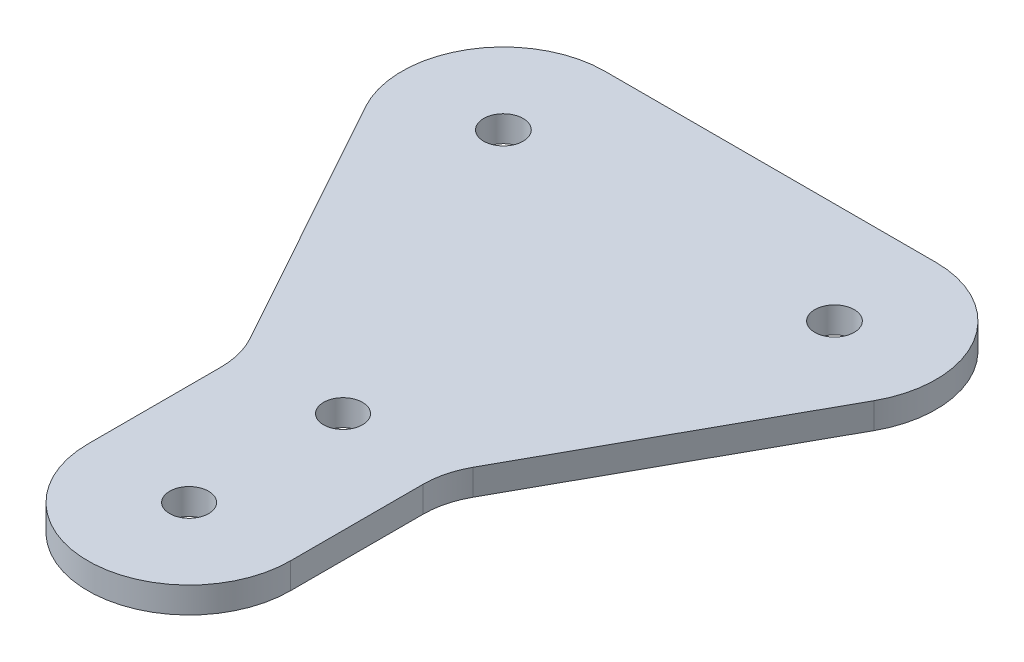
ISO-10303-21;
HEADER;
FILE_DESCRIPTION(('STEP AP214'),'2;1');
FILE_NAME('part.step','',(''),(''),'','','');
FILE_SCHEMA(('AUTOMOTIVE_DESIGN { 1 0 10303 214 1 1 1 1 }'));
ENDSEC;
DATA;
#1=APPLICATION_CONTEXT('core data for automotive mechanical design processes');
#2=APPLICATION_PROTOCOL_DEFINITION('international standard','automotive_design',2000,#1);
#3=PRODUCT_CONTEXT('',#1,'mechanical');
#4=PRODUCT('Part','Part','',(#3));
#5=PRODUCT_RELATED_PRODUCT_CATEGORY('part','',(#4));
#6=PRODUCT_DEFINITION_FORMATION('','',#4);
#7=PRODUCT_DEFINITION_CONTEXT('part definition',#1,'design');
#8=PRODUCT_DEFINITION('design','',#6,#7);
#9=PRODUCT_DEFINITION_SHAPE('','',#8);
#10=(LENGTH_UNIT() NAMED_UNIT(*) SI_UNIT(.MILLI.,.METRE.));
#11=(NAMED_UNIT(*) PLANE_ANGLE_UNIT() SI_UNIT($,.RADIAN.));
#12=(NAMED_UNIT(*) SI_UNIT($,.STERADIAN.) SOLID_ANGLE_UNIT());
#13=UNCERTAINTY_MEASURE_WITH_UNIT(LENGTH_MEASURE(1.E-05),#10,'distance_accuracy_value','');
#14=(GEOMETRIC_REPRESENTATION_CONTEXT(3) GLOBAL_UNCERTAINTY_ASSIGNED_CONTEXT((#13)) GLOBAL_UNIT_ASSIGNED_CONTEXT((#10,
#11,#12)) REPRESENTATION_CONTEXT('',''));
#15=CARTESIAN_POINT('',(0.,0.,0.));
#16=DIRECTION('',(0.,0.,1.));
#17=DIRECTION('',(1.,0.,0.));
#18=AXIS2_PLACEMENT_3D('',#15,#16,#17);
#19=CARTESIAN_POINT('',(12.3812499999981,3.175,-5.93428033430808E-13));
#20=DIRECTION('',(1.,0.,0.));
#21=DIRECTION('',(0.,0.,-1.));
#22=AXIS2_PLACEMENT_3D('',#19,#20,#21);
#23=PLANE('',#22);
#24=DIRECTION('',(0.,0.,1.));
#25=VECTOR('',#24,1.);
#26=CARTESIAN_POINT('',(12.3812499999981,0.,-5.93428033430808E-13));
#27=LINE('',#26,#25);
#28=CARTESIAN_POINT('',(12.3812499999987,0.,13.1142353977075));
#29=VERTEX_POINT('',#28);
#30=CARTESIAN_POINT('',(12.3812499999995,0.,29.3528750215412));
#31=VERTEX_POINT('',#30);
#32=EDGE_CURVE('E305',#29,#31,#27,.T.);
#33=ORIENTED_EDGE('',*,*,#32,.F.);
#34=DIRECTION('',(0.,-1.,0.));
#35=VECTOR('',#34,1.);
#36=CARTESIAN_POINT('',(12.3812499999987,3.175,13.1142353977075));
#37=LINE('',#36,#35);
#38=CARTESIAN_POINT('',(12.3812499999987,3.175,13.1142353977075));
#39=VERTEX_POINT('',#38);
#40=EDGE_CURVE('E55',#29,#39,#37,.F.);
#41=ORIENTED_EDGE('',*,*,#40,.T.);
#42=DIRECTION('',(0.,0.,1.));
#43=VECTOR('',#42,1.);
#44=CARTESIAN_POINT('',(12.3812499999981,3.175,-5.93428033430808E-13));
#45=LINE('',#44,#43);
#46=CARTESIAN_POINT('',(12.3812499999995,3.175,29.3528750215412));
#47=VERTEX_POINT('',#46);
#48=EDGE_CURVE('E143',#39,#47,#45,.T.);
#49=ORIENTED_EDGE('',*,*,#48,.T.);
#50=DIRECTION('',(0.,-1.,0.));
#51=VECTOR('',#50,1.);
#52=CARTESIAN_POINT('',(12.3812499999995,3.175,29.3528750215412));
#53=LINE('',#52,#51);
#54=EDGE_CURVE('E261',#47,#31,#53,.T.);
#55=ORIENTED_EDGE('',*,*,#54,.T.);
#56=EDGE_LOOP('',(#33,#41,#49,#55));
#57=FACE_BOUND('',#56,.T.);
#58=ADVANCED_FACE('F39',(#57),#23,.T.);
#59=CARTESIAN_POINT('',(13.9411713541731,3.175,7.71281282075999));
#60=DIRECTION('',(0.875016084061658,0.,0.484093846927847));
#61=DIRECTION('',(0.484093846927847,0.,-0.875016084061658));
#62=AXIS2_PLACEMENT_3D('',#59,#60,#61);
#63=PLANE('',#62);
#64=DIRECTION('',(-0.484093846927848,0.,0.875016084061658));
#65=VECTOR('',#64,1.);
#66=CARTESIAN_POINT('',(13.9411713541731,3.175,7.71281282075999));
#67=LINE('',#66,#65);
#68=CARTESIAN_POINT('',(31.1053746276231,3.175,-23.3120680565467));
#69=VERTEX_POINT('',#68);
#70=CARTESIAN_POINT('',(13.6310891593822,3.175,8.27329692842851));
#71=VERTEX_POINT('',#70);
#72=EDGE_CURVE('E120',#69,#71,#67,.T.);
#73=ORIENTED_EDGE('',*,*,#72,.T.);
#74=DIRECTION('',(0.,-1.,0.));
#75=VECTOR('',#74,1.);
#76=CARTESIAN_POINT('',(13.6310891593822,0.,8.27329692842851));
#77=LINE('',#76,#75);
#78=CARTESIAN_POINT('',(13.6310891593822,0.,8.27329692842851));
#79=VERTEX_POINT('',#78);
#80=EDGE_CURVE('E242',#71,#79,#77,.T.);
#81=ORIENTED_EDGE('',*,*,#80,.T.);
#82=DIRECTION('',(-0.484093846927848,0.,0.875016084061658));
#83=VECTOR('',#82,1.);
#84=CARTESIAN_POINT('',(13.9411713541731,0.,7.71281282075999));
#85=LINE('',#84,#83);
#86=CARTESIAN_POINT('',(31.1053746276231,0.,-23.3120680565467));
#87=VERTEX_POINT('',#86);
#88=EDGE_CURVE('E122',#87,#79,#85,.T.);
#89=ORIENTED_EDGE('',*,*,#88,.F.);
#90=DIRECTION('',(0.,-1.,0.));
#91=VECTOR('',#90,1.);
#92=CARTESIAN_POINT('',(31.1053746276231,3.175,-23.3120680565467));
#93=LINE('',#92,#91);
#94=EDGE_CURVE('E115',#69,#87,#93,.T.);
#95=ORIENTED_EDGE('',*,*,#94,.F.);
#96=EDGE_LOOP('',(#73,#81,#89,#95));
#97=FACE_BOUND('',#96,.T.);
#98=ADVANCED_FACE('F117',(#97),#63,.T.);
#99=CARTESIAN_POINT('',(20.2437999761667,3.175,-29.3211249784616));
#100=DIRECTION('',(0.,-1.,0.));
#101=DIRECTION('',(0.,0.,-1.));
#102=AXIS2_PLACEMENT_3D('',#99,#100,#101);
#103=CYLINDRICAL_SURFACE('',#102,12.4129999999979);
#104=CARTESIAN_POINT('',(20.2437999761667,0.,-29.3211249784616));
#105=DIRECTION('',(0.,1.,0.));
#106=DIRECTION('',(0.,0.,1.));
#107=AXIS2_PLACEMENT_3D('',#104,#105,#106);
#108=CIRCLE('',#107,12.4129999999979);
#109=CARTESIAN_POINT('',(20.2437999999999,0.,-41.7341249784605));
#110=VERTEX_POINT('',#109);
#111=EDGE_CURVE('E300',#87,#110,#108,.T.);
#112=ORIENTED_EDGE('',*,*,#111,.T.);
#113=DIRECTION('',(0.,-1.,0.));
#114=VECTOR('',#113,1.);
#115=CARTESIAN_POINT('',(20.2437999999999,3.175,-41.7341249784605));
#116=LINE('',#115,#114);
#117=CARTESIAN_POINT('',(20.2437999999999,3.175,-41.7341249784605));
#118=VERTEX_POINT('',#117);
#119=EDGE_CURVE('E128',#118,#110,#116,.T.);
#120=ORIENTED_EDGE('',*,*,#119,.F.);
#121=CARTESIAN_POINT('',(20.2437999761667,3.175,-29.3211249784616));
#122=DIRECTION('',(0.,1.,0.));
#123=DIRECTION('',(0.,0.,1.));
#124=AXIS2_PLACEMENT_3D('',#121,#122,#123);
#125=CIRCLE('',#124,12.4129999999979);
#126=EDGE_CURVE('E131',#69,#118,#125,.T.);
#127=ORIENTED_EDGE('',*,*,#126,.F.);
#128=ORIENTED_EDGE('',*,*,#94,.T.);
#129=EDGE_LOOP('',(#112,#120,#127,#128));
#130=FACE_BOUND('',#129,.T.);
#131=ADVANCED_FACE('F132',(#130),#103,.T.);
#132=CARTESIAN_POINT('',(0.,3.175,-41.7341249784616));
#133=DIRECTION('',(0.,0.,-1.));
#134=DIRECTION('',(-1.,0.,0.));
#135=AXIS2_PLACEMENT_3D('',#132,#133,#134);
#136=PLANE('',#135);
#137=DIRECTION('',(1.,0.,0.));
#138=VECTOR('',#137,1.);
#139=CARTESIAN_POINT('',(0.,0.,-41.7341249784616));
#140=LINE('',#139,#138);
#141=CARTESIAN_POINT('',(-20.2438000000003,0.,-41.7341249784608));
#142=VERTEX_POINT('',#141);
#143=EDGE_CURVE('E296',#142,#110,#140,.T.);
#144=ORIENTED_EDGE('',*,*,#143,.F.);
#145=DIRECTION('',(0.,-1.,0.));
#146=VECTOR('',#145,1.);
#147=CARTESIAN_POINT('',(-20.2438000000003,3.175,-41.7341249784608));
#148=LINE('',#147,#146);
#149=CARTESIAN_POINT('',(-20.2438000000003,3.175,-41.7341249784608));
#150=VERTEX_POINT('',#149);
#151=EDGE_CURVE('E251',#150,#142,#148,.T.);
#152=ORIENTED_EDGE('',*,*,#151,.F.);
#153=DIRECTION('',(1.,0.,0.));
#154=VECTOR('',#153,1.);
#155=CARTESIAN_POINT('',(0.,3.175,-41.7341249784616));
#156=LINE('',#155,#154);
#157=EDGE_CURVE('E137',#150,#118,#156,.T.);
#158=ORIENTED_EDGE('',*,*,#157,.T.);
#159=ORIENTED_EDGE('',*,*,#119,.T.);
#160=EDGE_LOOP('',(#144,#152,#158,#159));
#161=FACE_BOUND('',#160,.T.);
#162=ADVANCED_FACE('F205',(#161),#136,.T.);
#163=CARTESIAN_POINT('',(-20.2438000000003,3.175,-29.3211249784598));
#164=DIRECTION('',(0.,-1.,0.));
#165=DIRECTION('',(0.,0.,-1.));
#166=AXIS2_PLACEMENT_3D('',#163,#164,#165);
#167=CYLINDRICAL_SURFACE('',#166,12.4130000000002);
#168=CARTESIAN_POINT('',(-20.2438000000003,0.,-29.3211249784598));
#169=DIRECTION('',(0.,1.,0.));
#170=DIRECTION('',(0.,0.,1.));
#171=AXIS2_PLACEMENT_3D('',#168,#169,#170);
#172=CIRCLE('',#171,12.4130000000002);
#173=CARTESIAN_POINT('',(-31.1053746482185,0.,-23.3120680506876));
#174=VERTEX_POINT('',#173);
#175=EDGE_CURVE('E292',#142,#174,#172,.T.);
#176=ORIENTED_EDGE('',*,*,#175,.T.);
#177=DIRECTION('',(0.,-1.,0.));
#178=VECTOR('',#177,1.);
#179=CARTESIAN_POINT('',(-31.1053746482185,3.175,-23.3120680506876));
#180=LINE('',#179,#178);
#181=CARTESIAN_POINT('',(-31.1053746482185,3.175,-23.3120680506876));
#182=VERTEX_POINT('',#181);
#183=EDGE_CURVE('E254',#182,#174,#180,.T.);
#184=ORIENTED_EDGE('',*,*,#183,.F.);
#185=CARTESIAN_POINT('',(-20.2438000000003,3.175,-29.3211249784598));
#186=DIRECTION('',(0.,1.,0.));
#187=DIRECTION('',(0.,0.,1.));
#188=AXIS2_PLACEMENT_3D('',#185,#186,#187);
#189=CIRCLE('',#188,12.4130000000002);
#190=EDGE_CURVE('E151',#150,#182,#189,.T.);
#191=ORIENTED_EDGE('',*,*,#190,.F.);
#192=ORIENTED_EDGE('',*,*,#151,.T.);
#193=EDGE_LOOP('',(#176,#184,#191,#192));
#194=FACE_BOUND('',#193,.T.);
#195=ADVANCED_FACE('F201',(#194),#167,.T.);
#196=CARTESIAN_POINT('',(-13.9411713515368,3.175,7.71281282911911));
#197=DIRECTION('',(-0.875016083800641,0.,0.484093847399643));
#198=DIRECTION('',(0.484093847399643,0.,0.875016083800641));
#199=AXIS2_PLACEMENT_3D('',#196,#197,#198);
#200=PLANE('',#199);
#201=DIRECTION('',(-0.484093847399643,0.,-0.875016083800641));
#202=VECTOR('',#201,1.);
#203=CARTESIAN_POINT('',(-13.9411713515368,0.,7.71281282911911));
#204=LINE('',#203,#202);
#205=CARTESIAN_POINT('',(-13.6310891619948,0.,8.27329692658663));
#206=VERTEX_POINT('',#205);
#207=EDGE_CURVE('E289',#206,#174,#204,.T.);
#208=ORIENTED_EDGE('',*,*,#207,.F.);
#209=DIRECTION('',(0.,-1.,0.));
#210=VECTOR('',#209,1.);
#211=CARTESIAN_POINT('',(-13.6310891619948,3.175,8.27329692658663));
#212=LINE('',#211,#210);
#213=CARTESIAN_POINT('',(-13.6310891619948,3.175,8.27329692658663));
#214=VERTEX_POINT('',#213);
#215=EDGE_CURVE('E229',#206,#214,#212,.F.);
#216=ORIENTED_EDGE('',*,*,#215,.T.);
#217=DIRECTION('',(-0.484093847399643,0.,-0.875016083800641));
#218=VECTOR('',#217,1.);
#219=CARTESIAN_POINT('',(-13.9411713515368,3.175,7.71281282911911));
#220=LINE('',#219,#218);
#221=EDGE_CURVE('E155',#214,#182,#220,.T.);
#222=ORIENTED_EDGE('',*,*,#221,.T.);
#223=ORIENTED_EDGE('',*,*,#183,.T.);
#224=EDGE_LOOP('',(#208,#216,#222,#223));
#225=FACE_BOUND('',#224,.T.);
#226=ADVANCED_FACE('F197',(#225),#200,.T.);
#227=CARTESIAN_POINT('',(-12.3812500000019,3.175,5.77451124838615E-13));
#228=DIRECTION('',(-1.,0.,0.));
#229=DIRECTION('',(0.,0.,1.));
#230=AXIS2_PLACEMENT_3D('',#227,#228,#229);
#231=PLANE('',#230);
#232=DIRECTION('',(0.,0.,-1.));
#233=VECTOR('',#232,1.);
#234=CARTESIAN_POINT('',(-12.3812500000019,3.175,5.77451124838615E-13));
#235=LINE('',#234,#233);
#236=CARTESIAN_POINT('',(-12.3812500000005,3.175,29.3528750215412));
#237=VERTEX_POINT('',#236);
#238=CARTESIAN_POINT('',(-12.3812500000013,3.175,13.1142354005826));
#239=VERTEX_POINT('',#238);
#240=EDGE_CURVE('E158',#237,#239,#235,.T.);
#241=ORIENTED_EDGE('',*,*,#240,.T.);
#242=DIRECTION('',(0.,-1.,0.));
#243=VECTOR('',#242,1.);
#244=CARTESIAN_POINT('',(-12.3812500000013,0.,13.1142354005826));
#245=LINE('',#244,#243);
#246=CARTESIAN_POINT('',(-12.3812500000013,0.,13.1142354005826));
#247=VERTEX_POINT('',#246);
#248=EDGE_CURVE('E127',#239,#247,#245,.T.);
#249=ORIENTED_EDGE('',*,*,#248,.T.);
#250=DIRECTION('',(0.,0.,-1.));
#251=VECTOR('',#250,1.);
#252=CARTESIAN_POINT('',(-12.3812500000019,0.,5.77451124838615E-13));
#253=LINE('',#252,#251);
#254=CARTESIAN_POINT('',(-12.3812500000005,0.,29.3528750215412));
#255=VERTEX_POINT('',#254);
#256=EDGE_CURVE('E285',#255,#247,#253,.T.);
#257=ORIENTED_EDGE('',*,*,#256,.F.);
#258=DIRECTION('',(0.,-1.,0.));
#259=VECTOR('',#258,1.);
#260=CARTESIAN_POINT('',(-12.3812500000005,3.175,29.3528750215412));
#261=LINE('',#260,#259);
#262=EDGE_CURVE('E258',#237,#255,#261,.T.);
#263=ORIENTED_EDGE('',*,*,#262,.F.);
#264=EDGE_LOOP('',(#241,#249,#257,#263));
#265=FACE_BOUND('',#264,.T.);
#266=ADVANCED_FACE('F194',(#265),#231,.T.);
#267=CARTESIAN_POINT('',(-20.2438000000001,3.175,-29.3211249784589));
#268=DIRECTION('',(0.,-1.,0.));
#269=DIRECTION('',(0.,0.,-1.));
#270=AXIS2_PLACEMENT_3D('',#267,#268,#269);
#271=CYLINDRICAL_SURFACE('',#270,2.41299999999999);
#272=CARTESIAN_POINT('',(-20.2438000000001,3.175,-29.3211249784589));
#273=DIRECTION('',(0.,1.,0.));
#274=DIRECTION('',(0.,0.,1.));
#275=AXIS2_PLACEMENT_3D('',#272,#273,#274);
#276=CIRCLE('',#275,2.41299999999999);
#277=CARTESIAN_POINT('',(-20.2438000000001,3.175,-26.9081249784589));
#278=VERTEX_POINT('',#277);
#279=EDGE_CURVE('E175',#278,#278,#276,.T.);
#280=ORIENTED_EDGE('',*,*,#279,.T.);
#281=EDGE_LOOP('',(#280));
#282=FACE_BOUND('',#281,.T.);
#283=CARTESIAN_POINT('',(-20.2438000000001,0.,-29.3211249784589));
#284=DIRECTION('',(0.,1.,0.));
#285=DIRECTION('',(0.,0.,1.));
#286=AXIS2_PLACEMENT_3D('',#283,#284,#285);
#287=CIRCLE('',#286,2.41299999999999);
#288=CARTESIAN_POINT('',(-20.2438000000001,0.,-26.9081249784589));
#289=VERTEX_POINT('',#288);
#290=EDGE_CURVE('E269',#289,#289,#287,.T.);
#291=ORIENTED_EDGE('',*,*,#290,.F.);
#292=EDGE_LOOP('',(#291));
#293=FACE_BOUND('',#292,.T.);
#294=ADVANCED_FACE('F183',(#282,#293),#271,.F.);
#295=CARTESIAN_POINT('',(4.02455846426619E-13,3.175,10.5324236946353));
#296=DIRECTION('',(0.,1.,0.));
#297=DIRECTION('',(1.,0.,1.25300761309401E-12));
#298=AXIS2_PLACEMENT_3D('',#295,#296,#297);
#299=ELLIPSE('',#298,2.38125,2.38121635917891);
#300=DIRECTION('',(0.,-1.,0.));
#301=VECTOR('',#300,1.);
#302=SURFACE_OF_LINEAR_EXTRUSION('',#299,#301);
#303=CARTESIAN_POINT('',(2.3812500000004,3.175,10.5324236946383));
#304=VERTEX_POINT('',#303);
#305=EDGE_CURVE('E170',#304,#304,#299,.T.);
#306=ORIENTED_EDGE('',*,*,#305,.T.);
#307=EDGE_LOOP('',(#306));
#308=FACE_BOUND('',#307,.T.);
#309=CARTESIAN_POINT('',(4.02455846426619E-13,0.,10.5324236946353));
#310=DIRECTION('',(0.,1.,0.));
#311=DIRECTION('',(1.,0.,1.25300761309401E-12));
#312=AXIS2_PLACEMENT_3D('',#309,#310,#311);
#313=ELLIPSE('',#312,2.38125,2.38121635917891);
#314=CARTESIAN_POINT('',(2.3812500000004,0.,10.5324236946383));
#315=VERTEX_POINT('',#314);
#316=EDGE_CURVE('E273',#315,#315,#313,.T.);
#317=ORIENTED_EDGE('',*,*,#316,.F.);
#318=EDGE_LOOP('',(#317));
#319=FACE_BOUND('',#318,.T.);
#320=ADVANCED_FACE('F178',(#308,#319),#302,.T.);
#321=CARTESIAN_POINT('',(-4.85722573273506E-13,3.175,29.3528750215412));
#322=DIRECTION('',(0.,-1.,0.));
#323=DIRECTION('',(0.,0.,-1.));
#324=AXIS2_PLACEMENT_3D('',#321,#322,#323);
#325=CYLINDRICAL_SURFACE('',#324,2.38125);
#326=CARTESIAN_POINT('',(-4.85722573273506E-13,3.175,29.3528750215412));
#327=DIRECTION('',(0.,1.,0.));
#328=DIRECTION('',(0.,0.,1.));
#329=AXIS2_PLACEMENT_3D('',#326,#327,#328);
#330=CIRCLE('',#329,2.38125);
#331=CARTESIAN_POINT('',(-4.85722573273506E-13,3.175,31.7341250215412));
#332=VERTEX_POINT('',#331);
#333=EDGE_CURVE('E166',#332,#332,#330,.T.);
#334=ORIENTED_EDGE('',*,*,#333,.T.);
#335=EDGE_LOOP('',(#334));
#336=FACE_BOUND('',#335,.T.);
#337=CARTESIAN_POINT('',(-4.85722573273506E-13,0.,29.3528750215412));
#338=DIRECTION('',(0.,1.,0.));
#339=DIRECTION('',(0.,0.,1.));
#340=AXIS2_PLACEMENT_3D('',#337,#338,#339);
#341=CIRCLE('',#340,2.38125);
#342=CARTESIAN_POINT('',(-4.85722573273506E-13,0.,31.7341250215412));
#343=VERTEX_POINT('',#342);
#344=EDGE_CURVE('E277',#343,#343,#341,.T.);
#345=ORIENTED_EDGE('',*,*,#344,.F.);
#346=EDGE_LOOP('',(#345));
#347=FACE_BOUND('',#346,.T.);
#348=ADVANCED_FACE('F182',(#336,#347),#325,.F.);
#349=CARTESIAN_POINT('',(-4.85722573273506E-13,3.175,29.3528750215412));
#350=DIRECTION('',(0.,-1.,0.));
#351=DIRECTION('',(0.,0.,-1.));
#352=AXIS2_PLACEMENT_3D('',#349,#350,#351);
#353=CYLINDRICAL_SURFACE('',#352,12.38125);
#354=CARTESIAN_POINT('',(-4.85722573273506E-13,0.,29.3528750215412));
#355=DIRECTION('',(0.,1.,0.));
#356=DIRECTION('',(0.,0.,1.));
#357=AXIS2_PLACEMENT_3D('',#354,#355,#356);
#358=CIRCLE('',#357,12.38125);
#359=EDGE_CURVE('E281',#255,#31,#358,.T.);
#360=ORIENTED_EDGE('',*,*,#359,.T.);
#361=ORIENTED_EDGE('',*,*,#54,.F.);
#362=CARTESIAN_POINT('',(-4.85722573273506E-13,3.175,29.3528750215412));
#363=DIRECTION('',(0.,1.,0.));
#364=DIRECTION('',(0.,0.,1.));
#365=AXIS2_PLACEMENT_3D('',#362,#363,#364);
#366=CIRCLE('',#365,12.38125);
#367=EDGE_CURVE('E162',#237,#47,#366,.T.);
#368=ORIENTED_EDGE('',*,*,#367,.F.);
#369=ORIENTED_EDGE('',*,*,#262,.T.);
#370=EDGE_LOOP('',(#360,#361,#368,#369));
#371=FACE_BOUND('',#370,.T.);
#372=ADVANCED_FACE('F188',(#371),#353,.T.);
#373=CARTESIAN_POINT('',(20.2438000000001,3.175,-29.3211250215412));
#374=DIRECTION('',(0.,-1.,0.));
#375=DIRECTION('',(0.,0.,-1.));
#376=AXIS2_PLACEMENT_3D('',#373,#374,#375);
#377=CYLINDRICAL_SURFACE('',#376,2.41299999999999);
#378=CARTESIAN_POINT('',(20.2438000000001,3.175,-29.3211250215412));
#379=DIRECTION('',(0.,1.,0.));
#380=DIRECTION('',(0.,0.,1.));
#381=AXIS2_PLACEMENT_3D('',#378,#379,#380);
#382=CIRCLE('',#381,2.41299999999999);
#383=CARTESIAN_POINT('',(20.2438000000001,3.175,-26.9081250215412));
#384=VERTEX_POINT('',#383);
#385=EDGE_CURVE('E265',#384,#384,#382,.T.);
#386=ORIENTED_EDGE('',*,*,#385,.T.);
#387=EDGE_LOOP('',(#386));
#388=FACE_BOUND('',#387,.T.);
#389=CARTESIAN_POINT('',(20.2438000000001,0.,-29.3211250215412));
#390=DIRECTION('',(0.,1.,0.));
#391=DIRECTION('',(0.,0.,1.));
#392=AXIS2_PLACEMENT_3D('',#389,#390,#391);
#393=CIRCLE('',#392,2.41299999999999);
#394=CARTESIAN_POINT('',(20.2438000000001,0.,-26.9081250215412));
#395=VERTEX_POINT('',#394);
#396=EDGE_CURVE('E146',#395,#395,#393,.T.);
#397=ORIENTED_EDGE('',*,*,#396,.F.);
#398=EDGE_LOOP('',(#397));
#399=FACE_BOUND('',#398,.T.);
#400=ADVANCED_FACE('F192',(#388,#399),#377,.F.);
#401=CARTESIAN_POINT('',(0.,3.175,0.));
#402=DIRECTION('',(0.,1.,0.));
#403=DIRECTION('',(0.,0.,1.));
#404=AXIS2_PLACEMENT_3D('',#401,#402,#403);
#405=PLANE('',#404);
#406=ORIENTED_EDGE('',*,*,#48,.F.);
#407=CARTESIAN_POINT('',(22.3812499999987,3.175,13.114235397707));
#408=DIRECTION('',(0.,1.,0.));
#409=DIRECTION('',(0.,0.,1.));
#410=AXIS2_PLACEMENT_3D('',#407,#408,#409);
#411=CIRCLE('',#410,10.);
#412=EDGE_CURVE('E11',#39,#71,#411,.F.);
#413=ORIENTED_EDGE('',*,*,#412,.T.);
#414=ORIENTED_EDGE('',*,*,#72,.F.);
#415=ORIENTED_EDGE('',*,*,#126,.T.);
#416=ORIENTED_EDGE('',*,*,#157,.F.);
#417=ORIENTED_EDGE('',*,*,#190,.T.);
#418=ORIENTED_EDGE('',*,*,#221,.F.);
#419=CARTESIAN_POINT('',(-22.3812500000013,3.175,13.1142354005831));
#420=DIRECTION('',(0.,1.,0.));
#421=DIRECTION('',(0.,0.,1.));
#422=AXIS2_PLACEMENT_3D('',#419,#420,#421);
#423=CIRCLE('',#422,10.);
#424=EDGE_CURVE('E228',#214,#239,#423,.F.);
#425=ORIENTED_EDGE('',*,*,#424,.T.);
#426=ORIENTED_EDGE('',*,*,#240,.F.);
#427=ORIENTED_EDGE('',*,*,#367,.T.);
#428=EDGE_LOOP('',(#406,#413,#414,#415,#416,#417,#418,#425,#426,#427));
#429=FACE_BOUND('',#428,.T.);
#430=ORIENTED_EDGE('',*,*,#333,.F.);
#431=EDGE_LOOP('',(#430));
#432=FACE_BOUND('',#431,.T.);
#433=ORIENTED_EDGE('',*,*,#305,.F.);
#434=EDGE_LOOP('',(#433));
#435=FACE_BOUND('',#434,.T.);
#436=ORIENTED_EDGE('',*,*,#279,.F.);
#437=EDGE_LOOP('',(#436));
#438=FACE_BOUND('',#437,.T.);
#439=ORIENTED_EDGE('',*,*,#385,.F.);
#440=EDGE_LOOP('',(#439));
#441=FACE_BOUND('',#440,.T.);
#442=ADVANCED_FACE('F139',(#429,#432,#435,#438,#441),#405,.T.);
#443=CARTESIAN_POINT('',(0.,0.,0.));
#444=DIRECTION('',(0.,1.,0.));
#445=DIRECTION('',(0.,0.,1.));
#446=AXIS2_PLACEMENT_3D('',#443,#444,#445);
#447=PLANE('',#446);
#448=ORIENTED_EDGE('',*,*,#88,.T.);
#449=CARTESIAN_POINT('',(22.3812499999987,0.,13.114235397707));
#450=DIRECTION('',(0.,1.,0.));
#451=DIRECTION('',(0.,0.,1.));
#452=AXIS2_PLACEMENT_3D('',#449,#450,#451);
#453=CIRCLE('',#452,10.);
#454=EDGE_CURVE('E48',#79,#29,#453,.T.);
#455=ORIENTED_EDGE('',*,*,#454,.T.);
#456=ORIENTED_EDGE('',*,*,#32,.T.);
#457=ORIENTED_EDGE('',*,*,#359,.F.);
#458=ORIENTED_EDGE('',*,*,#256,.T.);
#459=CARTESIAN_POINT('',(-22.3812500000013,0.,13.1142354005831));
#460=DIRECTION('',(0.,1.,0.));
#461=DIRECTION('',(0.,0.,1.));
#462=AXIS2_PLACEMENT_3D('',#459,#460,#461);
#463=CIRCLE('',#462,10.);
#464=EDGE_CURVE('E234',#247,#206,#463,.T.);
#465=ORIENTED_EDGE('',*,*,#464,.T.);
#466=ORIENTED_EDGE('',*,*,#207,.T.);
#467=ORIENTED_EDGE('',*,*,#175,.F.);
#468=ORIENTED_EDGE('',*,*,#143,.T.);
#469=ORIENTED_EDGE('',*,*,#111,.F.);
#470=EDGE_LOOP('',(#448,#455,#456,#457,#458,#465,#466,#467,#468,#469));
#471=FACE_BOUND('',#470,.T.);
#472=ORIENTED_EDGE('',*,*,#344,.T.);
#473=EDGE_LOOP('',(#472));
#474=FACE_BOUND('',#473,.T.);
#475=ORIENTED_EDGE('',*,*,#316,.T.);
#476=EDGE_LOOP('',(#475));
#477=FACE_BOUND('',#476,.T.);
#478=ORIENTED_EDGE('',*,*,#290,.T.);
#479=EDGE_LOOP('',(#478));
#480=FACE_BOUND('',#479,.T.);
#481=ORIENTED_EDGE('',*,*,#396,.T.);
#482=EDGE_LOOP('',(#481));
#483=FACE_BOUND('',#482,.T.);
#484=ADVANCED_FACE('F217',(#471,#474,#477,#480,#483),#447,.F.);
#485=CARTESIAN_POINT('',(-22.3812500000013,3.175,13.1142354005831));
#486=DIRECTION('',(0.,1.,0.));
#487=DIRECTION('',(0.,0.,1.));
#488=AXIS2_PLACEMENT_3D('',#485,#486,#487);
#489=CYLINDRICAL_SURFACE('',#488,10.);
#490=ORIENTED_EDGE('',*,*,#424,.F.);
#491=ORIENTED_EDGE('',*,*,#215,.F.);
#492=ORIENTED_EDGE('',*,*,#464,.F.);
#493=ORIENTED_EDGE('',*,*,#248,.F.);
#494=EDGE_LOOP('',(#490,#491,#492,#493));
#495=FACE_BOUND('',#494,.T.);
#496=ADVANCED_FACE('F215',(#495),#489,.F.);
#497=CARTESIAN_POINT('',(22.3812499999987,3.175,13.114235397707));
#498=DIRECTION('',(0.,1.,0.));
#499=DIRECTION('',(0.,0.,1.));
#500=AXIS2_PLACEMENT_3D('',#497,#498,#499);
#501=CYLINDRICAL_SURFACE('',#500,10.);
#502=ORIENTED_EDGE('',*,*,#412,.F.);
#503=ORIENTED_EDGE('',*,*,#40,.F.);
#504=ORIENTED_EDGE('',*,*,#454,.F.);
#505=ORIENTED_EDGE('',*,*,#80,.F.);
#506=EDGE_LOOP('',(#502,#503,#504,#505));
#507=FACE_BOUND('',#506,.T.);
#508=ADVANCED_FACE('F41',(#507),#501,.F.);
#509=CLOSED_SHELL('',(#58,#98,#131,#162,#195,#226,#266,#294,#320,#348,#372,#400,#442,#484,#496,#508));
#510=MANIFOLD_SOLID_BREP('B2',#509);
#511=ADVANCED_BREP_SHAPE_REPRESENTATION('',(#18,#510),#14);
#512=SHAPE_DEFINITION_REPRESENTATION(#9,#511);
ENDSEC;
END-ISO-10303-21;
